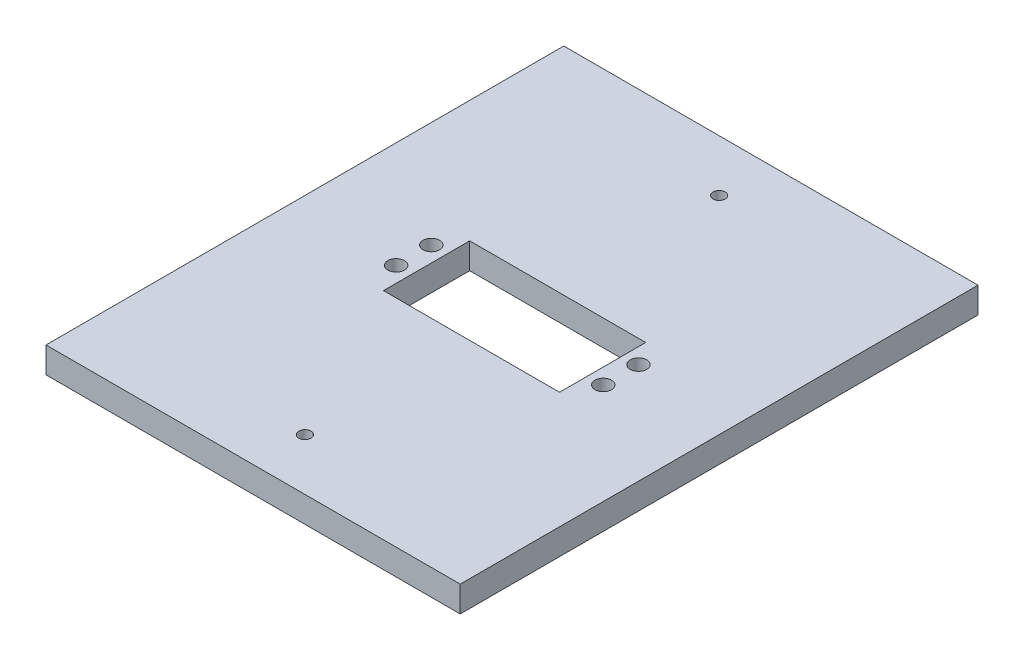
ISO-10303-21;
HEADER;
FILE_DESCRIPTION(('STEP AP214'),'2;1');
FILE_NAME('part.step','',(''),(''),'','','');
FILE_SCHEMA(('AUTOMOTIVE_DESIGN { 1 0 10303 214 1 1 1 1 }'));
ENDSEC;
DATA;
#1=APPLICATION_CONTEXT('core data for automotive mechanical design processes');
#2=APPLICATION_PROTOCOL_DEFINITION('international standard','automotive_design',2000,#1);
#3=PRODUCT_CONTEXT('',#1,'mechanical');
#4=PRODUCT('Part','Part','',(#3));
#5=PRODUCT_RELATED_PRODUCT_CATEGORY('part','',(#4));
#6=PRODUCT_DEFINITION_FORMATION('','',#4);
#7=PRODUCT_DEFINITION_CONTEXT('part definition',#1,'design');
#8=PRODUCT_DEFINITION('design','',#6,#7);
#9=PRODUCT_DEFINITION_SHAPE('','',#8);
#10=(LENGTH_UNIT() NAMED_UNIT(*) SI_UNIT(.MILLI.,.METRE.));
#11=(NAMED_UNIT(*) PLANE_ANGLE_UNIT() SI_UNIT($,.RADIAN.));
#12=(NAMED_UNIT(*) SI_UNIT($,.STERADIAN.) SOLID_ANGLE_UNIT());
#13=UNCERTAINTY_MEASURE_WITH_UNIT(LENGTH_MEASURE(1.E-05),#10,'distance_accuracy_value','');
#14=(GEOMETRIC_REPRESENTATION_CONTEXT(3) GLOBAL_UNCERTAINTY_ASSIGNED_CONTEXT((#13)) GLOBAL_UNIT_ASSIGNED_CONTEXT((#10,
#11,#12)) REPRESENTATION_CONTEXT('',''));
#15=CARTESIAN_POINT('',(0.,0.,0.));
#16=DIRECTION('',(0.,0.,1.));
#17=DIRECTION('',(1.,0.,0.));
#18=AXIS2_PLACEMENT_3D('',#15,#16,#17);
#19=CARTESIAN_POINT('',(185.42,6.35,-184.15));
#20=DIRECTION('',(-1.,0.,0.));
#21=DIRECTION('',(0.,0.,1.));
#22=AXIS2_PLACEMENT_3D('',#19,#20,#21);
#23=PLANE('',#22);
#24=DIRECTION('',(0.,0.,-1.));
#25=VECTOR('',#24,1.);
#26=CARTESIAN_POINT('',(185.42,0.,-184.15));
#27=LINE('',#26,#25);
#28=CARTESIAN_POINT('',(185.42,0.,-57.15));
#29=VERTEX_POINT('',#28);
#30=CARTESIAN_POINT('',(185.42,0.,-184.15));
#31=VERTEX_POINT('',#30);
#32=EDGE_CURVE('E135',#29,#31,#27,.T.);
#33=ORIENTED_EDGE('',*,*,#32,.T.);
#34=DIRECTION('',(0.,-1.,0.));
#35=VECTOR('',#34,1.);
#36=CARTESIAN_POINT('',(185.42,6.35,-184.15));
#37=LINE('',#36,#35);
#38=CARTESIAN_POINT('',(185.42,6.35,-184.15));
#39=VERTEX_POINT('',#38);
#40=EDGE_CURVE('E11',#39,#31,#37,.T.);
#41=ORIENTED_EDGE('',*,*,#40,.F.);
#42=DIRECTION('',(0.,0.,-1.));
#43=VECTOR('',#42,1.);
#44=CARTESIAN_POINT('',(185.42,6.35,-184.15));
#45=LINE('',#44,#43);
#46=CARTESIAN_POINT('',(185.42,6.35,-57.15));
#47=VERTEX_POINT('',#46);
#48=EDGE_CURVE('E139',#47,#39,#45,.T.);
#49=ORIENTED_EDGE('',*,*,#48,.F.);
#50=DIRECTION('',(0.,-1.,0.));
#51=VECTOR('',#50,1.);
#52=CARTESIAN_POINT('',(185.42,6.35,-57.15));
#53=LINE('',#52,#51);
#54=EDGE_CURVE('E149',#47,#29,#53,.T.);
#55=ORIENTED_EDGE('',*,*,#54,.T.);
#56=EDGE_LOOP('',(#33,#41,#49,#55));
#57=FACE_BOUND('',#56,.T.);
#58=ADVANCED_FACE('F34',(#57),#23,.F.);
#59=CARTESIAN_POINT('',(185.42,6.35,-184.15));
#60=DIRECTION('',(0.,0.,1.));
#61=DIRECTION('',(1.,0.,0.));
#62=AXIS2_PLACEMENT_3D('',#59,#60,#61);
#63=PLANE('',#62);
#64=DIRECTION('',(-1.,0.,0.));
#65=VECTOR('',#64,1.);
#66=CARTESIAN_POINT('',(185.42,0.,-184.15));
#67=LINE('',#66,#65);
#68=CARTESIAN_POINT('',(83.82,0.,-184.15));
#69=VERTEX_POINT('',#68);
#70=EDGE_CURVE('E152',#31,#69,#67,.T.);
#71=ORIENTED_EDGE('',*,*,#70,.T.);
#72=DIRECTION('',(0.,-1.,0.));
#73=VECTOR('',#72,1.);
#74=CARTESIAN_POINT('',(83.82,6.35,-184.15));
#75=LINE('',#74,#73);
#76=CARTESIAN_POINT('',(83.82,6.35,-184.15));
#77=VERTEX_POINT('',#76);
#78=EDGE_CURVE('E41',#77,#69,#75,.T.);
#79=ORIENTED_EDGE('',*,*,#78,.F.);
#80=DIRECTION('',(-1.,0.,0.));
#81=VECTOR('',#80,1.);
#82=CARTESIAN_POINT('',(185.42,6.35,-184.15));
#83=LINE('',#82,#81);
#84=EDGE_CURVE('E142',#39,#77,#83,.T.);
#85=ORIENTED_EDGE('',*,*,#84,.F.);
#86=ORIENTED_EDGE('',*,*,#40,.T.);
#87=EDGE_LOOP('',(#71,#79,#85,#86));
#88=FACE_BOUND('',#87,.T.);
#89=ADVANCED_FACE('F180',(#88),#63,.F.);
#90=CARTESIAN_POINT('',(83.82,6.35,-184.15));
#91=DIRECTION('',(1.,0.,0.));
#92=DIRECTION('',(0.,0.,-1.));
#93=AXIS2_PLACEMENT_3D('',#90,#91,#92);
#94=PLANE('',#93);
#95=DIRECTION('',(0.,0.,1.));
#96=VECTOR('',#95,1.);
#97=CARTESIAN_POINT('',(83.82,0.,-184.15));
#98=LINE('',#97,#96);
#99=CARTESIAN_POINT('',(83.82,0.,-57.15));
#100=VERTEX_POINT('',#99);
#101=EDGE_CURVE('E154',#69,#100,#98,.T.);
#102=ORIENTED_EDGE('',*,*,#101,.T.);
#103=DIRECTION('',(0.,-1.,0.));
#104=VECTOR('',#103,1.);
#105=CARTESIAN_POINT('',(83.82,6.35,-57.15));
#106=LINE('',#105,#104);
#107=CARTESIAN_POINT('',(83.82,6.35,-57.15));
#108=VERTEX_POINT('',#107);
#109=EDGE_CURVE('E159',#108,#100,#106,.T.);
#110=ORIENTED_EDGE('',*,*,#109,.F.);
#111=DIRECTION('',(0.,0.,1.));
#112=VECTOR('',#111,1.);
#113=CARTESIAN_POINT('',(83.82,6.35,-184.15));
#114=LINE('',#113,#112);
#115=EDGE_CURVE('E145',#77,#108,#114,.T.);
#116=ORIENTED_EDGE('',*,*,#115,.F.);
#117=ORIENTED_EDGE('',*,*,#78,.T.);
#118=EDGE_LOOP('',(#102,#110,#116,#117));
#119=FACE_BOUND('',#118,.T.);
#120=ADVANCED_FACE('F166',(#119),#94,.F.);
#121=CARTESIAN_POINT('',(185.42,6.35,-57.15));
#122=DIRECTION('',(0.,0.,-1.));
#123=DIRECTION('',(-1.,0.,0.));
#124=AXIS2_PLACEMENT_3D('',#121,#122,#123);
#125=PLANE('',#124);
#126=DIRECTION('',(1.,0.,0.));
#127=VECTOR('',#126,1.);
#128=CARTESIAN_POINT('',(185.42,0.,-57.15));
#129=LINE('',#128,#127);
#130=EDGE_CURVE('E143',#100,#29,#129,.T.);
#131=ORIENTED_EDGE('',*,*,#130,.T.);
#132=ORIENTED_EDGE('',*,*,#54,.F.);
#133=DIRECTION('',(1.,0.,0.));
#134=VECTOR('',#133,1.);
#135=CARTESIAN_POINT('',(185.42,6.35,-57.15));
#136=LINE('',#135,#134);
#137=EDGE_CURVE('E147',#108,#47,#136,.T.);
#138=ORIENTED_EDGE('',*,*,#137,.F.);
#139=ORIENTED_EDGE('',*,*,#109,.T.);
#140=EDGE_LOOP('',(#131,#132,#138,#139));
#141=FACE_BOUND('',#140,.T.);
#142=ADVANCED_FACE('F173',(#141),#125,.F.);
#143=CARTESIAN_POINT('',(0.,6.35,0.));
#144=DIRECTION('',(0.,-1.,0.));
#145=DIRECTION('',(0.,0.,-1.));
#146=AXIS2_PLACEMENT_3D('',#143,#144,#145);
#147=PLANE('',#146);
#148=CARTESIAN_POINT('',(134.62,6.35,-69.85));
#149=DIRECTION('',(0.,1.,0.));
#150=DIRECTION('',(0.,0.,-1.));
#151=AXIS2_PLACEMENT_3D('',#148,#149,#150);
#152=CIRCLE('',#151,1.5);
#153=CARTESIAN_POINT('',(134.62,6.35,-71.35));
#154=VERTEX_POINT('',#153);
#155=EDGE_CURVE('E238',#154,#154,#152,.T.);
#156=ORIENTED_EDGE('',*,*,#155,.F.);
#157=EDGE_LOOP('',(#156));
#158=FACE_BOUND('',#157,.T.);
#159=CARTESIAN_POINT('',(134.62,6.35,-171.45));
#160=DIRECTION('',(0.,1.,0.));
#161=DIRECTION('',(0.,0.,1.));
#162=AXIS2_PLACEMENT_3D('',#159,#160,#161);
#163=CIRCLE('',#162,1.5);
#164=CARTESIAN_POINT('',(134.62,6.35,-169.95));
#165=VERTEX_POINT('',#164);
#166=EDGE_CURVE('E240',#165,#165,#163,.T.);
#167=ORIENTED_EDGE('',*,*,#166,.F.);
#168=EDGE_LOOP('',(#167));
#169=FACE_BOUND('',#168,.T.);
#170=CARTESIAN_POINT('',(109.855,6.35,-116.99875));
#171=DIRECTION('',(0.,1.,0.));
#172=DIRECTION('',(0.,0.,1.));
#173=AXIS2_PLACEMENT_3D('',#170,#171,#172);
#174=CIRCLE('',#173,2.032);
#175=CARTESIAN_POINT('',(109.855,6.35,-114.96675));
#176=VERTEX_POINT('',#175);
#177=EDGE_CURVE('E250',#176,#176,#174,.T.);
#178=ORIENTED_EDGE('',*,*,#177,.F.);
#179=EDGE_LOOP('',(#178));
#180=FACE_BOUND('',#179,.T.);
#181=CARTESIAN_POINT('',(109.855,6.35,-125.63475));
#182=DIRECTION('',(0.,1.,0.));
#183=DIRECTION('',(0.,0.,-1.));
#184=AXIS2_PLACEMENT_3D('',#181,#182,#183);
#185=CIRCLE('',#184,2.03199999999998);
#186=CARTESIAN_POINT('',(109.855,6.35,-127.66675));
#187=VERTEX_POINT('',#186);
#188=EDGE_CURVE('E256',#187,#187,#185,.T.);
#189=ORIENTED_EDGE('',*,*,#188,.F.);
#190=EDGE_LOOP('',(#189));
#191=FACE_BOUND('',#190,.T.);
#192=CARTESIAN_POINT('',(160.655,6.35,-125.63475));
#193=DIRECTION('',(0.,1.,0.));
#194=DIRECTION('',(0.,0.,1.));
#195=AXIS2_PLACEMENT_3D('',#192,#193,#194);
#196=CIRCLE('',#195,2.03199999999999);
#197=CARTESIAN_POINT('',(160.655,6.35,-123.60275));
#198=VERTEX_POINT('',#197);
#199=EDGE_CURVE('E262',#198,#198,#196,.T.);
#200=ORIENTED_EDGE('',*,*,#199,.F.);
#201=EDGE_LOOP('',(#200));
#202=FACE_BOUND('',#201,.T.);
#203=CARTESIAN_POINT('',(160.655,6.35,-116.99875));
#204=DIRECTION('',(0.,1.,0.));
#205=DIRECTION('',(0.,0.,-1.));
#206=AXIS2_PLACEMENT_3D('',#203,#204,#205);
#207=CIRCLE('',#206,2.03200000000001);
#208=CARTESIAN_POINT('',(160.655,6.35,-119.03075));
#209=VERTEX_POINT('',#208);
#210=EDGE_CURVE('E122',#209,#209,#207,.T.);
#211=ORIENTED_EDGE('',*,*,#210,.F.);
#212=EDGE_LOOP('',(#211));
#213=FACE_BOUND('',#212,.T.);
#214=DIRECTION('',(1.,0.,0.));
#215=VECTOR('',#214,1.);
#216=CARTESIAN_POINT('',(113.665,6.35,-110.07725));
#217=LINE('',#216,#215);
#218=CARTESIAN_POINT('',(113.665,6.35,-110.07725));
#219=VERTEX_POINT('',#218);
#220=CARTESIAN_POINT('',(156.845,6.35,-110.07725));
#221=VERTEX_POINT('',#220);
#222=EDGE_CURVE('E128',#219,#221,#217,.T.);
#223=ORIENTED_EDGE('',*,*,#222,.F.);
#224=DIRECTION('',(0.,0.,1.));
#225=VECTOR('',#224,1.);
#226=CARTESIAN_POINT('',(113.665,6.35,-131.22275));
#227=LINE('',#226,#225);
#228=CARTESIAN_POINT('',(113.665,6.35,-131.22275));
#229=VERTEX_POINT('',#228);
#230=EDGE_CURVE('E48',#229,#219,#227,.T.);
#231=ORIENTED_EDGE('',*,*,#230,.F.);
#232=DIRECTION('',(-1.,0.,0.));
#233=VECTOR('',#232,1.);
#234=CARTESIAN_POINT('',(113.665,6.35,-131.22275));
#235=LINE('',#234,#233);
#236=CARTESIAN_POINT('',(156.845,6.35,-131.22275));
#237=VERTEX_POINT('',#236);
#238=EDGE_CURVE('E116',#237,#229,#235,.T.);
#239=ORIENTED_EDGE('',*,*,#238,.F.);
#240=DIRECTION('',(0.,0.,-1.));
#241=VECTOR('',#240,1.);
#242=CARTESIAN_POINT('',(156.845,6.35,-131.22275));
#243=LINE('',#242,#241);
#244=EDGE_CURVE('E119',#221,#237,#243,.T.);
#245=ORIENTED_EDGE('',*,*,#244,.F.);
#246=EDGE_LOOP('',(#223,#231,#239,#245));
#247=FACE_BOUND('',#246,.T.);
#248=ORIENTED_EDGE('',*,*,#48,.T.);
#249=ORIENTED_EDGE('',*,*,#84,.T.);
#250=ORIENTED_EDGE('',*,*,#115,.T.);
#251=ORIENTED_EDGE('',*,*,#137,.T.);
#252=EDGE_LOOP('',(#248,#249,#250,#251));
#253=FACE_BOUND('',#252,.T.);
#254=ADVANCED_FACE('F179',(#158,#169,#180,#191,#202,#213,#247,#253),#147,.F.);
#255=CARTESIAN_POINT('',(0.,0.,0.));
#256=DIRECTION('',(0.,-1.,0.));
#257=DIRECTION('',(0.,0.,-1.));
#258=AXIS2_PLACEMENT_3D('',#255,#256,#257);
#259=PLANE('',#258);
#260=CARTESIAN_POINT('',(134.62,0.,-69.85));
#261=DIRECTION('',(0.,1.,0.));
#262=DIRECTION('',(0.,0.,-1.));
#263=AXIS2_PLACEMENT_3D('',#260,#261,#262);
#264=CIRCLE('',#263,1.5);
#265=CARTESIAN_POINT('',(134.62,0.,-71.35));
#266=VERTEX_POINT('',#265);
#267=EDGE_CURVE('E235',#266,#266,#264,.T.);
#268=ORIENTED_EDGE('',*,*,#267,.T.);
#269=EDGE_LOOP('',(#268));
#270=FACE_BOUND('',#269,.T.);
#271=CARTESIAN_POINT('',(134.62,0.,-171.45));
#272=DIRECTION('',(0.,1.,0.));
#273=DIRECTION('',(0.,0.,1.));
#274=AXIS2_PLACEMENT_3D('',#271,#272,#273);
#275=CIRCLE('',#274,1.5);
#276=CARTESIAN_POINT('',(134.62,0.,-169.95));
#277=VERTEX_POINT('',#276);
#278=EDGE_CURVE('E243',#277,#277,#275,.T.);
#279=ORIENTED_EDGE('',*,*,#278,.T.);
#280=EDGE_LOOP('',(#279));
#281=FACE_BOUND('',#280,.T.);
#282=CARTESIAN_POINT('',(109.855,0.,-116.99875));
#283=DIRECTION('',(0.,1.,0.));
#284=DIRECTION('',(0.,0.,1.));
#285=AXIS2_PLACEMENT_3D('',#282,#283,#284);
#286=CIRCLE('',#285,2.032);
#287=CARTESIAN_POINT('',(109.855,0.,-114.96675));
#288=VERTEX_POINT('',#287);
#289=EDGE_CURVE('E129',#288,#288,#286,.T.);
#290=ORIENTED_EDGE('',*,*,#289,.T.);
#291=EDGE_LOOP('',(#290));
#292=FACE_BOUND('',#291,.T.);
#293=CARTESIAN_POINT('',(109.855,0.,-125.63475));
#294=DIRECTION('',(0.,1.,0.));
#295=DIRECTION('',(0.,0.,-1.));
#296=AXIS2_PLACEMENT_3D('',#293,#294,#295);
#297=CIRCLE('',#296,2.03199999999998);
#298=CARTESIAN_POINT('',(109.855,0.,-127.66675));
#299=VERTEX_POINT('',#298);
#300=EDGE_CURVE('E253',#299,#299,#297,.T.);
#301=ORIENTED_EDGE('',*,*,#300,.T.);
#302=EDGE_LOOP('',(#301));
#303=FACE_BOUND('',#302,.T.);
#304=CARTESIAN_POINT('',(160.655,0.,-125.63475));
#305=DIRECTION('',(0.,1.,0.));
#306=DIRECTION('',(0.,0.,1.));
#307=AXIS2_PLACEMENT_3D('',#304,#305,#306);
#308=CIRCLE('',#307,2.03199999999999);
#309=CARTESIAN_POINT('',(160.655,0.,-123.60275));
#310=VERTEX_POINT('',#309);
#311=EDGE_CURVE('E259',#310,#310,#308,.T.);
#312=ORIENTED_EDGE('',*,*,#311,.T.);
#313=EDGE_LOOP('',(#312));
#314=FACE_BOUND('',#313,.T.);
#315=CARTESIAN_POINT('',(160.655,0.,-116.99875));
#316=DIRECTION('',(0.,1.,0.));
#317=DIRECTION('',(0.,0.,-1.));
#318=AXIS2_PLACEMENT_3D('',#315,#316,#317);
#319=CIRCLE('',#318,2.03200000000001);
#320=CARTESIAN_POINT('',(160.655,0.,-119.03075));
#321=VERTEX_POINT('',#320);
#322=EDGE_CURVE('E264',#321,#321,#319,.T.);
#323=ORIENTED_EDGE('',*,*,#322,.T.);
#324=EDGE_LOOP('',(#323));
#325=FACE_BOUND('',#324,.T.);
#326=DIRECTION('',(0.,0.,1.));
#327=VECTOR('',#326,1.);
#328=CARTESIAN_POINT('',(113.665,0.,-131.22275));
#329=LINE('',#328,#327);
#330=CARTESIAN_POINT('',(113.665,0.,-131.22275));
#331=VERTEX_POINT('',#330);
#332=CARTESIAN_POINT('',(113.665,0.,-110.07725));
#333=VERTEX_POINT('',#332);
#334=EDGE_CURVE('E100',#331,#333,#329,.T.);
#335=ORIENTED_EDGE('',*,*,#334,.T.);
#336=DIRECTION('',(1.,0.,0.));
#337=VECTOR('',#336,1.);
#338=CARTESIAN_POINT('',(113.665,0.,-110.07725));
#339=LINE('',#338,#337);
#340=CARTESIAN_POINT('',(156.845,0.,-110.07725));
#341=VERTEX_POINT('',#340);
#342=EDGE_CURVE('E109',#333,#341,#339,.T.);
#343=ORIENTED_EDGE('',*,*,#342,.T.);
#344=DIRECTION('',(0.,0.,-1.));
#345=VECTOR('',#344,1.);
#346=CARTESIAN_POINT('',(156.845,0.,-131.22275));
#347=LINE('',#346,#345);
#348=CARTESIAN_POINT('',(156.845,0.,-131.22275));
#349=VERTEX_POINT('',#348);
#350=EDGE_CURVE('E56',#341,#349,#347,.T.);
#351=ORIENTED_EDGE('',*,*,#350,.T.);
#352=DIRECTION('',(-1.,0.,0.));
#353=VECTOR('',#352,1.);
#354=CARTESIAN_POINT('',(113.665,0.,-131.22275));
#355=LINE('',#354,#353);
#356=EDGE_CURVE('E106',#349,#331,#355,.T.);
#357=ORIENTED_EDGE('',*,*,#356,.T.);
#358=EDGE_LOOP('',(#335,#343,#351,#357));
#359=FACE_BOUND('',#358,.T.);
#360=ORIENTED_EDGE('',*,*,#32,.F.);
#361=ORIENTED_EDGE('',*,*,#130,.F.);
#362=ORIENTED_EDGE('',*,*,#101,.F.);
#363=ORIENTED_EDGE('',*,*,#70,.F.);
#364=EDGE_LOOP('',(#360,#361,#362,#363));
#365=FACE_BOUND('',#364,.T.);
#366=ADVANCED_FACE('F113',(#270,#281,#292,#303,#314,#325,#359,#365),#259,.T.);
#367=CARTESIAN_POINT('',(113.665,0.,-131.22275));
#368=DIRECTION('',(-1.,0.,0.));
#369=DIRECTION('',(0.,0.,1.));
#370=AXIS2_PLACEMENT_3D('',#367,#368,#369);
#371=PLANE('',#370);
#372=ORIENTED_EDGE('',*,*,#230,.T.);
#373=DIRECTION('',(0.,1.,0.));
#374=VECTOR('',#373,1.);
#375=CARTESIAN_POINT('',(113.665,0.,-110.07725));
#376=LINE('',#375,#374);
#377=EDGE_CURVE('E96',#333,#219,#376,.T.);
#378=ORIENTED_EDGE('',*,*,#377,.F.);
#379=ORIENTED_EDGE('',*,*,#334,.F.);
#380=DIRECTION('',(0.,1.,0.));
#381=VECTOR('',#380,1.);
#382=CARTESIAN_POINT('',(113.665,0.,-131.22275));
#383=LINE('',#382,#381);
#384=EDGE_CURVE('E133',#331,#229,#383,.T.);
#385=ORIENTED_EDGE('',*,*,#384,.T.);
#386=EDGE_LOOP('',(#372,#378,#379,#385));
#387=FACE_BOUND('',#386,.T.);
#388=ADVANCED_FACE('F98',(#387),#371,.F.);
#389=CARTESIAN_POINT('',(113.665,0.,-131.22275));
#390=DIRECTION('',(0.,0.,-1.));
#391=DIRECTION('',(-1.,0.,0.));
#392=AXIS2_PLACEMENT_3D('',#389,#390,#391);
#393=PLANE('',#392);
#394=ORIENTED_EDGE('',*,*,#238,.T.);
#395=ORIENTED_EDGE('',*,*,#384,.F.);
#396=ORIENTED_EDGE('',*,*,#356,.F.);
#397=DIRECTION('',(0.,1.,0.));
#398=VECTOR('',#397,1.);
#399=CARTESIAN_POINT('',(156.845,0.,-131.22275));
#400=LINE('',#399,#398);
#401=EDGE_CURVE('E136',#349,#237,#400,.T.);
#402=ORIENTED_EDGE('',*,*,#401,.T.);
#403=EDGE_LOOP('',(#394,#395,#396,#402));
#404=FACE_BOUND('',#403,.T.);
#405=ADVANCED_FACE('F198',(#404),#393,.F.);
#406=CARTESIAN_POINT('',(156.845,0.,-131.22275));
#407=DIRECTION('',(1.,0.,0.));
#408=DIRECTION('',(0.,0.,-1.));
#409=AXIS2_PLACEMENT_3D('',#406,#407,#408);
#410=PLANE('',#409);
#411=ORIENTED_EDGE('',*,*,#244,.T.);
#412=ORIENTED_EDGE('',*,*,#401,.F.);
#413=ORIENTED_EDGE('',*,*,#350,.F.);
#414=DIRECTION('',(0.,1.,0.));
#415=VECTOR('',#414,1.);
#416=CARTESIAN_POINT('',(156.845,0.,-110.07725));
#417=LINE('',#416,#415);
#418=EDGE_CURVE('E105',#341,#221,#417,.T.);
#419=ORIENTED_EDGE('',*,*,#418,.T.);
#420=EDGE_LOOP('',(#411,#412,#413,#419));
#421=FACE_BOUND('',#420,.T.);
#422=ADVANCED_FACE('F202',(#421),#410,.F.);
#423=CARTESIAN_POINT('',(113.665,0.,-110.07725));
#424=DIRECTION('',(0.,0.,1.));
#425=DIRECTION('',(1.,0.,0.));
#426=AXIS2_PLACEMENT_3D('',#423,#424,#425);
#427=PLANE('',#426);
#428=ORIENTED_EDGE('',*,*,#222,.T.);
#429=ORIENTED_EDGE('',*,*,#418,.F.);
#430=ORIENTED_EDGE('',*,*,#342,.F.);
#431=ORIENTED_EDGE('',*,*,#377,.T.);
#432=EDGE_LOOP('',(#428,#429,#430,#431));
#433=FACE_BOUND('',#432,.T.);
#434=ADVANCED_FACE('F110',(#433),#427,.F.);
#435=CARTESIAN_POINT('',(160.655,0.,-116.99875));
#436=DIRECTION('',(0.,1.,0.));
#437=DIRECTION('',(0.,0.,1.));
#438=AXIS2_PLACEMENT_3D('',#435,#436,#437);
#439=CYLINDRICAL_SURFACE('',#438,2.03200000000001);
#440=ORIENTED_EDGE('',*,*,#322,.F.);
#441=EDGE_LOOP('',(#440));
#442=FACE_BOUND('',#441,.T.);
#443=ORIENTED_EDGE('',*,*,#210,.T.);
#444=EDGE_LOOP('',(#443));
#445=FACE_BOUND('',#444,.T.);
#446=ADVANCED_FACE('F201',(#442,#445),#439,.F.);
#447=CARTESIAN_POINT('',(160.655,0.,-125.63475));
#448=DIRECTION('',(0.,1.,0.));
#449=DIRECTION('',(0.,0.,1.));
#450=AXIS2_PLACEMENT_3D('',#447,#448,#449);
#451=CYLINDRICAL_SURFACE('',#450,2.03199999999999);
#452=ORIENTED_EDGE('',*,*,#311,.F.);
#453=EDGE_LOOP('',(#452));
#454=FACE_BOUND('',#453,.T.);
#455=ORIENTED_EDGE('',*,*,#199,.T.);
#456=EDGE_LOOP('',(#455));
#457=FACE_BOUND('',#456,.T.);
#458=ADVANCED_FACE('F210',(#454,#457),#451,.F.);
#459=CARTESIAN_POINT('',(109.855,0.,-125.63475));
#460=DIRECTION('',(0.,1.,0.));
#461=DIRECTION('',(0.,0.,1.));
#462=AXIS2_PLACEMENT_3D('',#459,#460,#461);
#463=CYLINDRICAL_SURFACE('',#462,2.03199999999998);
#464=ORIENTED_EDGE('',*,*,#300,.F.);
#465=EDGE_LOOP('',(#464));
#466=FACE_BOUND('',#465,.T.);
#467=ORIENTED_EDGE('',*,*,#188,.T.);
#468=EDGE_LOOP('',(#467));
#469=FACE_BOUND('',#468,.T.);
#470=ADVANCED_FACE('F214',(#466,#469),#463,.F.);
#471=CARTESIAN_POINT('',(109.855,0.,-116.99875));
#472=DIRECTION('',(0.,1.,0.));
#473=DIRECTION('',(0.,0.,1.));
#474=AXIS2_PLACEMENT_3D('',#471,#472,#473);
#475=CYLINDRICAL_SURFACE('',#474,2.032);
#476=ORIENTED_EDGE('',*,*,#289,.F.);
#477=EDGE_LOOP('',(#476));
#478=FACE_BOUND('',#477,.T.);
#479=ORIENTED_EDGE('',*,*,#177,.T.);
#480=EDGE_LOOP('',(#479));
#481=FACE_BOUND('',#480,.T.);
#482=ADVANCED_FACE('F218',(#478,#481),#475,.F.);
#483=CARTESIAN_POINT('',(134.62,0.,-171.45));
#484=DIRECTION('',(0.,1.,0.));
#485=DIRECTION('',(0.,0.,1.));
#486=AXIS2_PLACEMENT_3D('',#483,#484,#485);
#487=CYLINDRICAL_SURFACE('',#486,1.5);
#488=ORIENTED_EDGE('',*,*,#278,.F.);
#489=EDGE_LOOP('',(#488));
#490=FACE_BOUND('',#489,.T.);
#491=ORIENTED_EDGE('',*,*,#166,.T.);
#492=EDGE_LOOP('',(#491));
#493=FACE_BOUND('',#492,.T.);
#494=ADVANCED_FACE('F222',(#490,#493),#487,.F.);
#495=CARTESIAN_POINT('',(134.62,0.,-69.85));
#496=DIRECTION('',(0.,1.,0.));
#497=DIRECTION('',(0.,0.,1.));
#498=AXIS2_PLACEMENT_3D('',#495,#496,#497);
#499=CYLINDRICAL_SURFACE('',#498,1.5);
#500=ORIENTED_EDGE('',*,*,#267,.F.);
#501=EDGE_LOOP('',(#500));
#502=FACE_BOUND('',#501,.T.);
#503=ORIENTED_EDGE('',*,*,#155,.T.);
#504=EDGE_LOOP('',(#503));
#505=FACE_BOUND('',#504,.T.);
#506=ADVANCED_FACE('F226',(#502,#505),#499,.F.);
#507=CLOSED_SHELL('',(#58,#89,#120,#142,#254,#366,#388,#405,#422,#434,#446,#458,#470,#482,#494,#506));
#508=MANIFOLD_SOLID_BREP('B2',#507);
#509=ADVANCED_BREP_SHAPE_REPRESENTATION('',(#18,#508),#14);
#510=SHAPE_DEFINITION_REPRESENTATION(#9,#509);
ENDSEC;
END-ISO-10303-21;
